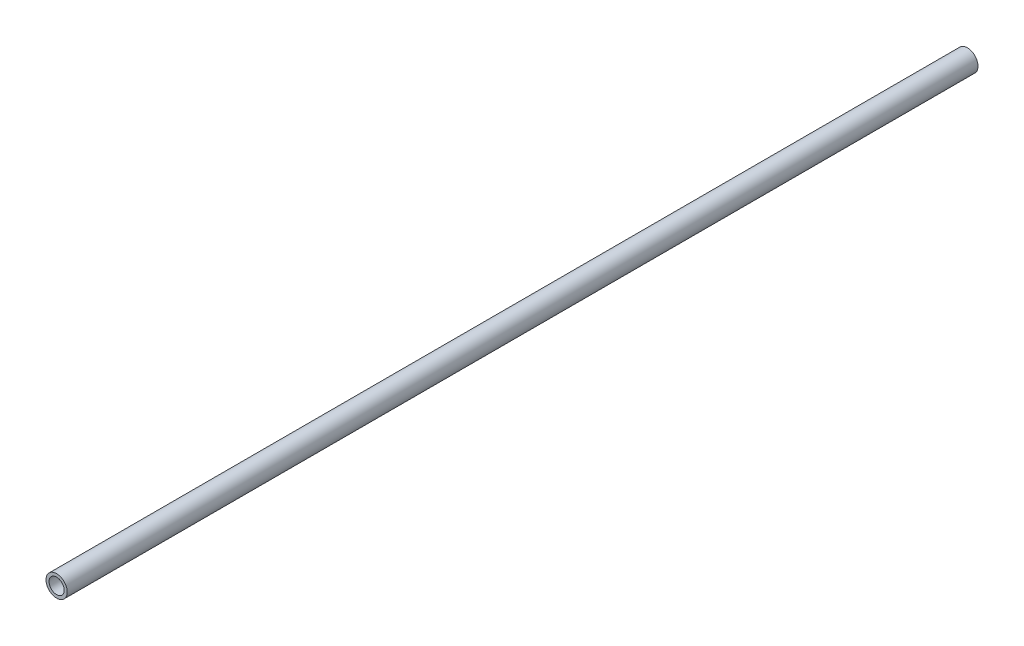
ISO-10303-21;
HEADER;
FILE_DESCRIPTION(('STEP AP214'),'2;1');
FILE_NAME('part.step','',(''),(''),'','','');
FILE_SCHEMA(('AUTOMOTIVE_DESIGN { 1 0 10303 214 1 1 1 1 }'));
ENDSEC;
DATA;
#1=APPLICATION_CONTEXT('core data for automotive mechanical design processes');
#2=APPLICATION_PROTOCOL_DEFINITION('international standard','automotive_design',2000,#1);
#3=PRODUCT_CONTEXT('',#1,'mechanical');
#4=PRODUCT('Part','Part','',(#3));
#5=PRODUCT_RELATED_PRODUCT_CATEGORY('part','',(#4));
#6=PRODUCT_DEFINITION_FORMATION('','',#4);
#7=PRODUCT_DEFINITION_CONTEXT('part definition',#1,'design');
#8=PRODUCT_DEFINITION('design','',#6,#7);
#9=PRODUCT_DEFINITION_SHAPE('','',#8);
#10=(LENGTH_UNIT() NAMED_UNIT(*) SI_UNIT(.MILLI.,.METRE.));
#11=(NAMED_UNIT(*) PLANE_ANGLE_UNIT() SI_UNIT($,.RADIAN.));
#12=(NAMED_UNIT(*) SI_UNIT($,.STERADIAN.) SOLID_ANGLE_UNIT());
#13=UNCERTAINTY_MEASURE_WITH_UNIT(LENGTH_MEASURE(1.E-05),#10,'distance_accuracy_value','');
#14=(GEOMETRIC_REPRESENTATION_CONTEXT(3) GLOBAL_UNCERTAINTY_ASSIGNED_CONTEXT((#13)) GLOBAL_UNIT_ASSIGNED_CONTEXT((#10,
#11,#12)) REPRESENTATION_CONTEXT('',''));
#15=CARTESIAN_POINT('',(0.,0.,0.));
#16=DIRECTION('',(0.,0.,1.));
#17=DIRECTION('',(1.,0.,0.));
#18=AXIS2_PLACEMENT_3D('',#15,#16,#17);
#19=CARTESIAN_POINT('',(47.9170752510567,71.5483238933913,-150.));
#20=DIRECTION('',(0.,0.,1.));
#21=DIRECTION('',(1.,0.,0.));
#22=AXIS2_PLACEMENT_3D('',#19,#20,#21);
#23=CYLINDRICAL_SURFACE('',#22,3.5);
#24=CARTESIAN_POINT('',(47.9170752510567,71.5483238933913,-150.));
#25=DIRECTION('',(0.,0.,1.));
#26=DIRECTION('',(1.,0.,0.));
#27=AXIS2_PLACEMENT_3D('',#24,#25,#26);
#28=CIRCLE('',#27,3.5);
#29=CARTESIAN_POINT('',(51.4170752510567,71.5483238933913,-150.));
#30=VERTEX_POINT('',#29);
#31=EDGE_CURVE('E10',#30,#30,#28,.T.);
#32=ORIENTED_EDGE('',*,*,#31,.T.);
#33=EDGE_LOOP('',(#32));
#34=FACE_BOUND('',#33,.T.);
#35=CARTESIAN_POINT('',(47.9170752510567,71.5483238933913,150.));
#36=DIRECTION('',(0.,0.,1.));
#37=DIRECTION('',(1.,0.,0.));
#38=AXIS2_PLACEMENT_3D('',#35,#36,#37);
#39=CIRCLE('',#38,3.5);
#40=CARTESIAN_POINT('',(51.4170752510567,71.5483238933913,150.));
#41=VERTEX_POINT('',#40);
#42=EDGE_CURVE('E34',#41,#41,#39,.T.);
#43=ORIENTED_EDGE('',*,*,#42,.F.);
#44=EDGE_LOOP('',(#43));
#45=FACE_BOUND('',#44,.T.);
#46=ADVANCED_FACE('F31',(#34,#45),#23,.T.);
#47=CARTESIAN_POINT('',(47.9170752510567,71.5483238933913,-150.));
#48=DIRECTION('',(0.,0.,1.));
#49=DIRECTION('',(1.,0.,0.));
#50=AXIS2_PLACEMENT_3D('',#47,#48,#49);
#51=PLANE('',#50);
#52=CARTESIAN_POINT('',(47.9170752510567,71.5483238933913,-150.));
#53=DIRECTION('',(0.,0.,1.));
#54=DIRECTION('',(1.,0.,0.));
#55=AXIS2_PLACEMENT_3D('',#52,#53,#54);
#56=CIRCLE('',#55,2.5);
#57=CARTESIAN_POINT('',(50.4170752510567,71.5483238933913,-150.));
#58=VERTEX_POINT('',#57);
#59=EDGE_CURVE('E41',#58,#58,#56,.T.);
#60=ORIENTED_EDGE('',*,*,#59,.T.);
#61=EDGE_LOOP('',(#60));
#62=FACE_BOUND('',#61,.T.);
#63=ORIENTED_EDGE('',*,*,#31,.F.);
#64=EDGE_LOOP('',(#63));
#65=FACE_BOUND('',#64,.T.);
#66=ADVANCED_FACE('F49',(#62,#65),#51,.F.);
#67=CARTESIAN_POINT('',(47.9170752510567,71.5483238933913,150.));
#68=DIRECTION('',(0.,0.,1.));
#69=DIRECTION('',(1.,0.,0.));
#70=AXIS2_PLACEMENT_3D('',#67,#68,#69);
#71=PLANE('',#70);
#72=CARTESIAN_POINT('',(47.9170752510567,71.5483238933913,150.));
#73=DIRECTION('',(0.,0.,1.));
#74=DIRECTION('',(1.,0.,0.));
#75=AXIS2_PLACEMENT_3D('',#72,#73,#74);
#76=CIRCLE('',#75,2.5);
#77=CARTESIAN_POINT('',(50.4170752510567,71.5483238933913,150.));
#78=VERTEX_POINT('',#77);
#79=EDGE_CURVE('E43',#78,#78,#76,.T.);
#80=ORIENTED_EDGE('',*,*,#79,.F.);
#81=EDGE_LOOP('',(#80));
#82=FACE_BOUND('',#81,.T.);
#83=ORIENTED_EDGE('',*,*,#42,.T.);
#84=EDGE_LOOP('',(#83));
#85=FACE_BOUND('',#84,.T.);
#86=ADVANCED_FACE('F55',(#82,#85),#71,.T.);
#87=CARTESIAN_POINT('',(47.9170752510567,71.5483238933913,-150.));
#88=DIRECTION('',(0.,0.,1.));
#89=DIRECTION('',(1.,0.,0.));
#90=AXIS2_PLACEMENT_3D('',#87,#88,#89);
#91=CYLINDRICAL_SURFACE('',#90,2.5);
#92=ORIENTED_EDGE('',*,*,#59,.F.);
#93=EDGE_LOOP('',(#92));
#94=FACE_BOUND('',#93,.T.);
#95=ORIENTED_EDGE('',*,*,#79,.T.);
#96=EDGE_LOOP('',(#95));
#97=FACE_BOUND('',#96,.T.);
#98=ADVANCED_FACE('F52',(#94,#97),#91,.F.);
#99=CLOSED_SHELL('',(#46,#66,#86,#98));
#100=MANIFOLD_SOLID_BREP('B2',#99);
#101=ADVANCED_BREP_SHAPE_REPRESENTATION('',(#18,#100),#14);
#102=SHAPE_DEFINITION_REPRESENTATION(#9,#101);
ENDSEC;
END-ISO-10303-21;
